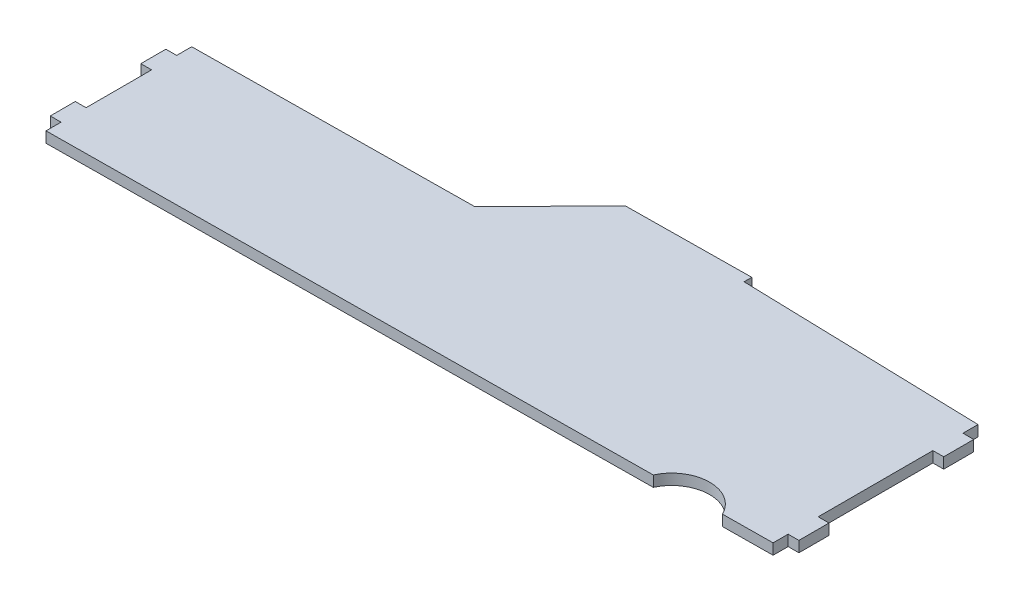
ISO-10303-21;
HEADER;
FILE_DESCRIPTION(('STEP AP214'),'2;1');
FILE_NAME('part.step','',(''),(''),'','','');
FILE_SCHEMA(('AUTOMOTIVE_DESIGN { 1 0 10303 214 1 1 1 1 }'));
ENDSEC;
DATA;
#1=APPLICATION_CONTEXT('core data for automotive mechanical design processes');
#2=APPLICATION_PROTOCOL_DEFINITION('international standard','automotive_design',2000,#1);
#3=PRODUCT_CONTEXT('',#1,'mechanical');
#4=PRODUCT('Part','Part','',(#3));
#5=PRODUCT_RELATED_PRODUCT_CATEGORY('part','',(#4));
#6=PRODUCT_DEFINITION_FORMATION('','',#4);
#7=PRODUCT_DEFINITION_CONTEXT('part definition',#1,'design');
#8=PRODUCT_DEFINITION('design','',#6,#7);
#9=PRODUCT_DEFINITION_SHAPE('','',#8);
#10=(LENGTH_UNIT() NAMED_UNIT(*) SI_UNIT(.MILLI.,.METRE.));
#11=(NAMED_UNIT(*) PLANE_ANGLE_UNIT() SI_UNIT($,.RADIAN.));
#12=(NAMED_UNIT(*) SI_UNIT($,.STERADIAN.) SOLID_ANGLE_UNIT());
#13=UNCERTAINTY_MEASURE_WITH_UNIT(LENGTH_MEASURE(1.E-05),#10,'distance_accuracy_value','');
#14=(GEOMETRIC_REPRESENTATION_CONTEXT(3) GLOBAL_UNCERTAINTY_ASSIGNED_CONTEXT((#13)) GLOBAL_UNIT_ASSIGNED_CONTEXT((#10,
#11,#12)) REPRESENTATION_CONTEXT('',''));
#15=CARTESIAN_POINT('',(0.,0.,0.));
#16=DIRECTION('',(0.,0.,1.));
#17=DIRECTION('',(1.,0.,0.));
#18=AXIS2_PLACEMENT_3D('',#15,#16,#17);
#19=CARTESIAN_POINT('',(-31.9346892249108,-4.3,41.3878146175006));
#20=DIRECTION('',(-0.714764112225223,0.,-0.699365615307822));
#21=DIRECTION('',(-0.699365615307822,0.,0.714764112225223));
#22=AXIS2_PLACEMENT_3D('',#19,#20,#21);
#23=PLANE('',#22);
#24=DIRECTION('',(-0.699365615307822,0.,0.714764112225223));
#25=VECTOR('',#24,1.);
#26=CARTESIAN_POINT('',(-31.9346892249108,0.,41.3878146175006));
#27=LINE('',#26,#25);
#28=CARTESIAN_POINT('',(-2.26311907813889,0.,11.0629415753062));
#29=VERTEX_POINT('',#28);
#30=CARTESIAN_POINT('',(-31.9346892249108,0.,41.3878146175006));
#31=VERTEX_POINT('',#30);
#32=EDGE_CURVE('E252',#29,#31,#27,.T.);
#33=ORIENTED_EDGE('',*,*,#32,.F.);
#34=DIRECTION('',(0.,1.,0.));
#35=VECTOR('',#34,1.);
#36=CARTESIAN_POINT('',(-2.26311907813889,-4.3,11.0629415753062));
#37=LINE('',#36,#35);
#38=CARTESIAN_POINT('',(-2.26311907813889,-4.3,11.0629415753062));
#39=VERTEX_POINT('',#38);
#40=EDGE_CURVE('E12',#39,#29,#37,.T.);
#41=ORIENTED_EDGE('',*,*,#40,.F.);
#42=DIRECTION('',(-0.699365615307822,0.,0.714764112225223));
#43=VECTOR('',#42,1.);
#44=CARTESIAN_POINT('',(-31.9346892249108,-4.3,41.3878146175006));
#45=LINE('',#44,#43);
#46=CARTESIAN_POINT('',(-31.9346892249108,-4.3,41.3878146175006));
#47=VERTEX_POINT('',#46);
#48=EDGE_CURVE('E326',#39,#47,#45,.T.);
#49=ORIENTED_EDGE('',*,*,#48,.T.);
#50=DIRECTION('',(0.,1.,0.));
#51=VECTOR('',#50,1.);
#52=CARTESIAN_POINT('',(-31.9346892249108,-4.3,41.3878146175006));
#53=LINE('',#52,#51);
#54=EDGE_CURVE('E50',#47,#31,#53,.T.);
#55=ORIENTED_EDGE('',*,*,#54,.T.);
#56=EDGE_LOOP('',(#33,#41,#49,#55));
#57=FACE_BOUND('',#56,.T.);
#58=ADVANCED_FACE('F47',(#57),#23,.T.);
#59=CARTESIAN_POINT('',(47.7368809218611,-4.3,10.5184902206107));
#60=DIRECTION('',(-0.01088838159038,0.,-0.999940719816101));
#61=DIRECTION('',(-0.999940719816101,0.,0.01088838159038));
#62=AXIS2_PLACEMENT_3D('',#59,#60,#61);
#63=PLANE('',#62);
#64=DIRECTION('',(-0.999940719816101,0.,0.01088838159038));
#65=VECTOR('',#64,1.);
#66=CARTESIAN_POINT('',(47.7368809218611,0.,10.5184902206107));
#67=LINE('',#66,#65);
#68=CARTESIAN_POINT('',(47.7368809218611,0.,10.5184902206107));
#69=VERTEX_POINT('',#68);
#70=EDGE_CURVE('E324',#69,#29,#67,.T.);
#71=ORIENTED_EDGE('',*,*,#70,.F.);
#72=DIRECTION('',(0.,1.,0.));
#73=VECTOR('',#72,1.);
#74=CARTESIAN_POINT('',(47.7368809218611,-4.3,10.5184902206107));
#75=LINE('',#74,#73);
#76=CARTESIAN_POINT('',(47.7368809218611,-4.3,10.5184902206107));
#77=VERTEX_POINT('',#76);
#78=EDGE_CURVE('E56',#77,#69,#75,.T.);
#79=ORIENTED_EDGE('',*,*,#78,.F.);
#80=DIRECTION('',(-0.999940719816101,0.,0.01088838159038));
#81=VECTOR('',#80,1.);
#82=CARTESIAN_POINT('',(47.7368809218611,-4.3,10.5184902206107));
#83=LINE('',#82,#81);
#84=EDGE_CURVE('E242',#77,#39,#83,.T.);
#85=ORIENTED_EDGE('',*,*,#84,.T.);
#86=ORIENTED_EDGE('',*,*,#40,.T.);
#87=EDGE_LOOP('',(#71,#79,#85,#86));
#88=FACE_BOUND('',#87,.T.);
#89=ADVANCED_FACE('F374',(#88),#63,.T.);
#90=CARTESIAN_POINT('',(47.7368809218611,-4.3,13.6103954383272));
#91=DIRECTION('',(1.,0.,0.));
#92=DIRECTION('',(0.,0.,-1.));
#93=AXIS2_PLACEMENT_3D('',#90,#91,#92);
#94=PLANE('',#93);
#95=DIRECTION('',(0.,0.,-1.));
#96=VECTOR('',#95,1.);
#97=CARTESIAN_POINT('',(47.7368809218611,0.,13.6103954383272));
#98=LINE('',#97,#96);
#99=CARTESIAN_POINT('',(47.7368809218611,0.,13.6103954383272));
#100=VERTEX_POINT('',#99);
#101=EDGE_CURVE('E229',#100,#69,#98,.T.);
#102=ORIENTED_EDGE('',*,*,#101,.F.);
#103=DIRECTION('',(0.,1.,0.));
#104=VECTOR('',#103,1.);
#105=CARTESIAN_POINT('',(47.7368809218611,-4.3,13.6103954383272));
#106=LINE('',#105,#104);
#107=CARTESIAN_POINT('',(47.7368809218611,-4.3,13.6103954383272));
#108=VERTEX_POINT('',#107);
#109=EDGE_CURVE('E224',#108,#100,#106,.T.);
#110=ORIENTED_EDGE('',*,*,#109,.F.);
#111=DIRECTION('',(0.,0.,-1.));
#112=VECTOR('',#111,1.);
#113=CARTESIAN_POINT('',(47.7368809218611,-4.3,13.6103954383272));
#114=LINE('',#113,#112);
#115=EDGE_CURVE('E227',#108,#77,#114,.T.);
#116=ORIENTED_EDGE('',*,*,#115,.T.);
#117=ORIENTED_EDGE('',*,*,#78,.T.);
#118=EDGE_LOOP('',(#102,#110,#116,#117));
#119=FACE_BOUND('',#118,.T.);
#120=ADVANCED_FACE('F226',(#119),#94,.T.);
#121=CARTESIAN_POINT('',(47.7368809218611,-4.3,13.6103954383272));
#122=DIRECTION('',(0.0276789308336633,0.,-0.999616864997737));
#123=DIRECTION('',(-0.999616864997738,0.,-0.0276789308336633));
#124=AXIS2_PLACEMENT_3D('',#121,#122,#123);
#125=PLANE('',#124);
#126=DIRECTION('',(-0.999616864997738,0.,-0.0276789308336633));
#127=VECTOR('',#126,1.);
#128=CARTESIAN_POINT('',(47.7368809218611,0.,13.6103954383272));
#129=LINE('',#128,#127);
#130=CARTESIAN_POINT('',(143.77908282957,0.,16.2697597976132));
#131=VERTEX_POINT('',#130);
#132=EDGE_CURVE('E321',#131,#100,#129,.T.);
#133=ORIENTED_EDGE('',*,*,#132,.F.);
#134=DIRECTION('',(0.,1.,0.));
#135=VECTOR('',#134,1.);
#136=CARTESIAN_POINT('',(143.77908282957,-4.3,16.2697597976132));
#137=LINE('',#136,#135);
#138=CARTESIAN_POINT('',(143.77908282957,-4.3,16.2697597976132));
#139=VERTEX_POINT('',#138);
#140=EDGE_CURVE('E234',#139,#131,#137,.T.);
#141=ORIENTED_EDGE('',*,*,#140,.F.);
#142=DIRECTION('',(-0.999616864997738,0.,-0.0276789308336633));
#143=VECTOR('',#142,1.);
#144=CARTESIAN_POINT('',(47.7368809218611,-4.3,13.6103954383272));
#145=LINE('',#144,#143);
#146=EDGE_CURVE('E240',#139,#108,#145,.T.);
#147=ORIENTED_EDGE('',*,*,#146,.T.);
#148=ORIENTED_EDGE('',*,*,#109,.T.);
#149=EDGE_LOOP('',(#133,#141,#147,#148));
#150=FACE_BOUND('',#149,.T.);
#151=ADVANCED_FACE('F244',(#150),#125,.T.);
#152=CARTESIAN_POINT('',(143.77908282957,-4.3,22.2697597976132));
#153=DIRECTION('',(1.,0.,0.));
#154=DIRECTION('',(0.,0.,-1.));
#155=AXIS2_PLACEMENT_3D('',#152,#153,#154);
#156=PLANE('',#155);
#157=DIRECTION('',(0.,0.,-1.));
#158=VECTOR('',#157,1.);
#159=CARTESIAN_POINT('',(143.77908282957,0.,22.2697597976132));
#160=LINE('',#159,#158);
#161=CARTESIAN_POINT('',(143.77908282957,0.,22.2697597976132));
#162=VERTEX_POINT('',#161);
#163=EDGE_CURVE('E318',#162,#131,#160,.T.);
#164=ORIENTED_EDGE('',*,*,#163,.F.);
#165=DIRECTION('',(0.,1.,0.));
#166=VECTOR('',#165,1.);
#167=CARTESIAN_POINT('',(143.77908282957,-4.3,22.2697597976132));
#168=LINE('',#167,#166);
#169=CARTESIAN_POINT('',(143.77908282957,-4.3,22.2697597976132));
#170=VERTEX_POINT('',#169);
#171=EDGE_CURVE('E330',#170,#162,#168,.T.);
#172=ORIENTED_EDGE('',*,*,#171,.F.);
#173=DIRECTION('',(0.,0.,-1.));
#174=VECTOR('',#173,1.);
#175=CARTESIAN_POINT('',(143.77908282957,-4.3,22.2697597976132));
#176=LINE('',#175,#174);
#177=EDGE_CURVE('E245',#170,#139,#176,.T.);
#178=ORIENTED_EDGE('',*,*,#177,.T.);
#179=ORIENTED_EDGE('',*,*,#140,.T.);
#180=EDGE_LOOP('',(#164,#172,#178,#179));
#181=FACE_BOUND('',#180,.T.);
#182=ADVANCED_FACE('F387',(#181),#156,.T.);
#183=CARTESIAN_POINT('',(143.77908282957,-4.3,22.2697597976132));
#184=DIRECTION('',(0.,0.,-1.));
#185=DIRECTION('',(-1.,0.,0.));
#186=AXIS2_PLACEMENT_3D('',#183,#184,#185);
#187=PLANE('',#186);
#188=DIRECTION('',(-1.,0.,0.));
#189=VECTOR('',#188,1.);
#190=CARTESIAN_POINT('',(143.77908282957,0.,22.2697597976132));
#191=LINE('',#190,#189);
#192=CARTESIAN_POINT('',(148.07908282957,0.,22.2697597976132));
#193=VERTEX_POINT('',#192);
#194=EDGE_CURVE('E315',#193,#162,#191,.T.);
#195=ORIENTED_EDGE('',*,*,#194,.F.);
#196=DIRECTION('',(0.,1.,0.));
#197=VECTOR('',#196,1.);
#198=CARTESIAN_POINT('',(148.07908282957,-4.3,22.2697597976132));
#199=LINE('',#198,#197);
#200=CARTESIAN_POINT('',(148.07908282957,-4.3,22.2697597976132));
#201=VERTEX_POINT('',#200);
#202=EDGE_CURVE('E332',#201,#193,#199,.T.);
#203=ORIENTED_EDGE('',*,*,#202,.F.);
#204=DIRECTION('',(-1.,0.,0.));
#205=VECTOR('',#204,1.);
#206=CARTESIAN_POINT('',(143.77908282957,-4.3,22.2697597976132));
#207=LINE('',#206,#205);
#208=EDGE_CURVE('E247',#201,#170,#207,.T.);
#209=ORIENTED_EDGE('',*,*,#208,.T.);
#210=ORIENTED_EDGE('',*,*,#171,.T.);
#211=EDGE_LOOP('',(#195,#203,#209,#210));
#212=FACE_BOUND('',#211,.T.);
#213=ADVANCED_FACE('F390',(#212),#187,.T.);
#214=CARTESIAN_POINT('',(148.07908282957,-4.3,34.2697597976132));
#215=DIRECTION('',(1.,0.,0.));
#216=DIRECTION('',(0.,0.,-1.));
#217=AXIS2_PLACEMENT_3D('',#214,#215,#216);
#218=PLANE('',#217);
#219=DIRECTION('',(0.,0.,-1.));
#220=VECTOR('',#219,1.);
#221=CARTESIAN_POINT('',(148.07908282957,0.,34.2697597976132));
#222=LINE('',#221,#220);
#223=CARTESIAN_POINT('',(148.07908282957,0.,34.2697597976132));
#224=VERTEX_POINT('',#223);
#225=EDGE_CURVE('E312',#224,#193,#222,.T.);
#226=ORIENTED_EDGE('',*,*,#225,.F.);
#227=DIRECTION('',(0.,1.,0.));
#228=VECTOR('',#227,1.);
#229=CARTESIAN_POINT('',(148.07908282957,-4.3,34.2697597976132));
#230=LINE('',#229,#228);
#231=CARTESIAN_POINT('',(148.07908282957,-4.3,34.2697597976132));
#232=VERTEX_POINT('',#231);
#233=EDGE_CURVE('E334',#232,#224,#230,.T.);
#234=ORIENTED_EDGE('',*,*,#233,.F.);
#235=DIRECTION('',(0.,0.,-1.));
#236=VECTOR('',#235,1.);
#237=CARTESIAN_POINT('',(148.07908282957,-4.3,34.2697597976132));
#238=LINE('',#237,#236);
#239=EDGE_CURVE('E711',#232,#201,#238,.T.);
#240=ORIENTED_EDGE('',*,*,#239,.T.);
#241=ORIENTED_EDGE('',*,*,#202,.T.);
#242=EDGE_LOOP('',(#226,#234,#240,#241));
#243=FACE_BOUND('',#242,.T.);
#244=ADVANCED_FACE('F394',(#243),#218,.T.);
#245=CARTESIAN_POINT('',(143.77908282957,-4.3,34.2697597976132));
#246=DIRECTION('',(0.,0.,1.));
#247=DIRECTION('',(1.,0.,0.));
#248=AXIS2_PLACEMENT_3D('',#245,#246,#247);
#249=PLANE('',#248);
#250=DIRECTION('',(1.,0.,0.));
#251=VECTOR('',#250,1.);
#252=CARTESIAN_POINT('',(143.77908282957,0.,34.2697597976132));
#253=LINE('',#252,#251);
#254=CARTESIAN_POINT('',(143.77908282957,0.,34.2697597976132));
#255=VERTEX_POINT('',#254);
#256=EDGE_CURVE('E309',#255,#224,#253,.T.);
#257=ORIENTED_EDGE('',*,*,#256,.F.);
#258=DIRECTION('',(0.,1.,0.));
#259=VECTOR('',#258,1.);
#260=CARTESIAN_POINT('',(143.77908282957,-4.3,34.2697597976132));
#261=LINE('',#260,#259);
#262=CARTESIAN_POINT('',(143.77908282957,-4.3,34.2697597976132));
#263=VERTEX_POINT('',#262);
#264=EDGE_CURVE('E336',#263,#255,#261,.T.);
#265=ORIENTED_EDGE('',*,*,#264,.F.);
#266=DIRECTION('',(1.,0.,0.));
#267=VECTOR('',#266,1.);
#268=CARTESIAN_POINT('',(143.77908282957,-4.3,34.2697597976132));
#269=LINE('',#268,#267);
#270=EDGE_CURVE('E704',#263,#232,#269,.T.);
#271=ORIENTED_EDGE('',*,*,#270,.T.);
#272=ORIENTED_EDGE('',*,*,#233,.T.);
#273=EDGE_LOOP('',(#257,#265,#271,#272));
#274=FACE_BOUND('',#273,.T.);
#275=ADVANCED_FACE('F398',(#274),#249,.T.);
#276=CARTESIAN_POINT('',(143.77908282957,-4.3,80.0683917908743));
#277=DIRECTION('',(1.,0.,0.));
#278=DIRECTION('',(0.,0.,-1.));
#279=AXIS2_PLACEMENT_3D('',#276,#277,#278);
#280=PLANE('',#279);
#281=DIRECTION('',(0.,0.,-1.));
#282=VECTOR('',#281,1.);
#283=CARTESIAN_POINT('',(143.77908282957,0.,80.0683917908743));
#284=LINE('',#283,#282);
#285=CARTESIAN_POINT('',(143.77908282957,0.,80.0683917908743));
#286=VERTEX_POINT('',#285);
#287=EDGE_CURVE('E306',#286,#255,#284,.T.);
#288=ORIENTED_EDGE('',*,*,#287,.F.);
#289=DIRECTION('',(0.,1.,0.));
#290=VECTOR('',#289,1.);
#291=CARTESIAN_POINT('',(143.77908282957,-4.3,80.0683917908743));
#292=LINE('',#291,#290);
#293=CARTESIAN_POINT('',(143.77908282957,-4.3,80.0683917908743));
#294=VERTEX_POINT('',#293);
#295=EDGE_CURVE('E338',#294,#286,#292,.T.);
#296=ORIENTED_EDGE('',*,*,#295,.F.);
#297=DIRECTION('',(0.,0.,-1.));
#298=VECTOR('',#297,1.);
#299=CARTESIAN_POINT('',(143.77908282957,-4.3,80.0683917908743));
#300=LINE('',#299,#298);
#301=EDGE_CURVE('E700',#294,#263,#300,.T.);
#302=ORIENTED_EDGE('',*,*,#301,.T.);
#303=ORIENTED_EDGE('',*,*,#264,.T.);
#304=EDGE_LOOP('',(#288,#296,#302,#303));
#305=FACE_BOUND('',#304,.T.);
#306=ADVANCED_FACE('F402',(#305),#280,.T.);
#307=CARTESIAN_POINT('',(143.77908282957,-4.3,80.0683917908743));
#308=DIRECTION('',(0.,0.,-1.));
#309=DIRECTION('',(-1.,0.,0.));
#310=AXIS2_PLACEMENT_3D('',#307,#308,#309);
#311=PLANE('',#310);
#312=DIRECTION('',(-1.,0.,0.));
#313=VECTOR('',#312,1.);
#314=CARTESIAN_POINT('',(143.77908282957,0.,80.0683917908743));
#315=LINE('',#314,#313);
#316=CARTESIAN_POINT('',(148.07908282957,0.,80.0683917908743));
#317=VERTEX_POINT('',#316);
#318=EDGE_CURVE('E303',#317,#286,#315,.T.);
#319=ORIENTED_EDGE('',*,*,#318,.F.);
#320=DIRECTION('',(0.,1.,0.));
#321=VECTOR('',#320,1.);
#322=CARTESIAN_POINT('',(148.07908282957,-4.3,80.0683917908743));
#323=LINE('',#322,#321);
#324=CARTESIAN_POINT('',(148.07908282957,-4.3,80.0683917908743));
#325=VERTEX_POINT('',#324);
#326=EDGE_CURVE('E340',#325,#317,#323,.T.);
#327=ORIENTED_EDGE('',*,*,#326,.F.);
#328=DIRECTION('',(-1.,0.,0.));
#329=VECTOR('',#328,1.);
#330=CARTESIAN_POINT('',(143.77908282957,-4.3,80.0683917908743));
#331=LINE('',#330,#329);
#332=EDGE_CURVE('E716',#325,#294,#331,.T.);
#333=ORIENTED_EDGE('',*,*,#332,.T.);
#334=ORIENTED_EDGE('',*,*,#295,.T.);
#335=EDGE_LOOP('',(#319,#327,#333,#334));
#336=FACE_BOUND('',#335,.T.);
#337=ADVANCED_FACE('F406',(#336),#311,.T.);
#338=CARTESIAN_POINT('',(148.07908282957,-4.3,92.0683917908743));
#339=DIRECTION('',(1.,0.,0.));
#340=DIRECTION('',(0.,0.,-1.));
#341=AXIS2_PLACEMENT_3D('',#338,#339,#340);
#342=PLANE('',#341);
#343=DIRECTION('',(0.,0.,-1.));
#344=VECTOR('',#343,1.);
#345=CARTESIAN_POINT('',(148.07908282957,0.,92.0683917908743));
#346=LINE('',#345,#344);
#347=CARTESIAN_POINT('',(148.07908282957,0.,92.0683917908743));
#348=VERTEX_POINT('',#347);
#349=EDGE_CURVE('E300',#348,#317,#346,.T.);
#350=ORIENTED_EDGE('',*,*,#349,.F.);
#351=DIRECTION('',(0.,1.,0.));
#352=VECTOR('',#351,1.);
#353=CARTESIAN_POINT('',(148.07908282957,-4.3,92.0683917908743));
#354=LINE('',#353,#352);
#355=CARTESIAN_POINT('',(148.07908282957,-4.3,92.0683917908743));
#356=VERTEX_POINT('',#355);
#357=EDGE_CURVE('E342',#356,#348,#354,.T.);
#358=ORIENTED_EDGE('',*,*,#357,.F.);
#359=DIRECTION('',(0.,0.,-1.));
#360=VECTOR('',#359,1.);
#361=CARTESIAN_POINT('',(148.07908282957,-4.3,92.0683917908743));
#362=LINE('',#361,#360);
#363=EDGE_CURVE('E693',#356,#325,#362,.T.);
#364=ORIENTED_EDGE('',*,*,#363,.T.);
#365=ORIENTED_EDGE('',*,*,#326,.T.);
#366=EDGE_LOOP('',(#350,#358,#364,#365));
#367=FACE_BOUND('',#366,.T.);
#368=ADVANCED_FACE('F410',(#367),#342,.T.);
#369=CARTESIAN_POINT('',(143.77908282957,-4.3,92.0683917908743));
#370=DIRECTION('',(0.,0.,1.));
#371=DIRECTION('',(1.,0.,0.));
#372=AXIS2_PLACEMENT_3D('',#369,#370,#371);
#373=PLANE('',#372);
#374=DIRECTION('',(1.,0.,0.));
#375=VECTOR('',#374,1.);
#376=CARTESIAN_POINT('',(143.77908282957,0.,92.0683917908743));
#377=LINE('',#376,#375);
#378=CARTESIAN_POINT('',(143.77908282957,0.,92.0683917908743));
#379=VERTEX_POINT('',#378);
#380=EDGE_CURVE('E297',#379,#348,#377,.T.);
#381=ORIENTED_EDGE('',*,*,#380,.F.);
#382=DIRECTION('',(0.,1.,0.));
#383=VECTOR('',#382,1.);
#384=CARTESIAN_POINT('',(143.77908282957,-4.3,92.0683917908743));
#385=LINE('',#384,#383);
#386=CARTESIAN_POINT('',(143.77908282957,-4.3,92.0683917908743));
#387=VERTEX_POINT('',#386);
#388=EDGE_CURVE('E344',#387,#379,#385,.T.);
#389=ORIENTED_EDGE('',*,*,#388,.F.);
#390=DIRECTION('',(1.,0.,0.));
#391=VECTOR('',#390,1.);
#392=CARTESIAN_POINT('',(143.77908282957,-4.3,92.0683917908743));
#393=LINE('',#392,#391);
#394=EDGE_CURVE('E689',#387,#356,#393,.T.);
#395=ORIENTED_EDGE('',*,*,#394,.T.);
#396=ORIENTED_EDGE('',*,*,#357,.T.);
#397=EDGE_LOOP('',(#381,#389,#395,#396));
#398=FACE_BOUND('',#397,.T.);
#399=ADVANCED_FACE('F414',(#398),#373,.T.);
#400=CARTESIAN_POINT('',(143.77908282957,-4.3,98.0683917908743));
#401=DIRECTION('',(1.,0.,0.));
#402=DIRECTION('',(0.,0.,-1.));
#403=AXIS2_PLACEMENT_3D('',#400,#401,#402);
#404=PLANE('',#403);
#405=DIRECTION('',(0.,0.,-1.));
#406=VECTOR('',#405,1.);
#407=CARTESIAN_POINT('',(143.77908282957,0.,98.0683917908743));
#408=LINE('',#407,#406);
#409=CARTESIAN_POINT('',(143.77908282957,0.,98.0683917908743));
#410=VERTEX_POINT('',#409);
#411=EDGE_CURVE('E294',#410,#379,#408,.T.);
#412=ORIENTED_EDGE('',*,*,#411,.F.);
#413=DIRECTION('',(0.,1.,0.));
#414=VECTOR('',#413,1.);
#415=CARTESIAN_POINT('',(143.77908282957,-4.3,98.0683917908743));
#416=LINE('',#415,#414);
#417=CARTESIAN_POINT('',(143.77908282957,-4.3,98.0683917908743));
#418=VERTEX_POINT('',#417);
#419=EDGE_CURVE('E346',#418,#410,#416,.T.);
#420=ORIENTED_EDGE('',*,*,#419,.F.);
#421=DIRECTION('',(0.,0.,-1.));
#422=VECTOR('',#421,1.);
#423=CARTESIAN_POINT('',(143.77908282957,-4.3,98.0683917908743));
#424=LINE('',#423,#422);
#425=EDGE_CURVE('E720',#418,#387,#424,.T.);
#426=ORIENTED_EDGE('',*,*,#425,.T.);
#427=ORIENTED_EDGE('',*,*,#388,.T.);
#428=EDGE_LOOP('',(#412,#420,#426,#427));
#429=FACE_BOUND('',#428,.T.);
#430=ADVANCED_FACE('F418',(#429),#404,.T.);
#431=CARTESIAN_POINT('',(143.77908282957,-4.3,98.0683917908743));
#432=DIRECTION('',(0.00936633570846425,0.,0.999956134915625));
#433=DIRECTION('',(0.999956134915626,0.,-0.00936633570846425));
#434=AXIS2_PLACEMENT_3D('',#431,#432,#433);
#435=PLANE('',#434);
#436=DIRECTION('',(0.999956134915625,0.,-0.00936633570846425));
#437=VECTOR('',#436,1.);
#438=CARTESIAN_POINT('',(143.77908282957,0.,98.0683917908743));
#439=LINE('',#438,#437);
#440=CARTESIAN_POINT('',(123.769012786662,0.,98.2558210460462));
#441=VERTEX_POINT('',#440);
#442=EDGE_CURVE('E291',#441,#410,#439,.T.);
#443=ORIENTED_EDGE('',*,*,#442,.F.);
#444=DIRECTION('',(0.,1.,0.));
#445=VECTOR('',#444,1.);
#446=CARTESIAN_POINT('',(123.769012786662,-4.3,98.2558210460462));
#447=LINE('',#446,#445);
#448=CARTESIAN_POINT('',(123.769012786662,-4.3,98.2558210460462));
#449=VERTEX_POINT('',#448);
#450=EDGE_CURVE('E348',#449,#441,#447,.T.);
#451=ORIENTED_EDGE('',*,*,#450,.F.);
#452=DIRECTION('',(0.999956134915625,0.,-0.00936633570846425));
#453=VECTOR('',#452,1.);
#454=CARTESIAN_POINT('',(143.77908282957,-4.3,98.0683917908743));
#455=LINE('',#454,#453);
#456=EDGE_CURVE('E682',#449,#418,#455,.T.);
#457=ORIENTED_EDGE('',*,*,#456,.T.);
#458=ORIENTED_EDGE('',*,*,#419,.T.);
#459=EDGE_LOOP('',(#443,#451,#457,#458));
#460=FACE_BOUND('',#459,.T.);
#461=ADVANCED_FACE('F422',(#460),#435,.T.);
#462=CARTESIAN_POINT('',(110.140489553155,-4.3,104.915689165582));
#463=DIRECTION('',(0.,1.,0.));
#464=DIRECTION('',(0.,0.,1.));
#465=AXIS2_PLACEMENT_3D('',#462,#463,#464);
#466=CYLINDRICAL_SURFACE('',#465,15.1687339252769);
#467=CARTESIAN_POINT('',(110.140489553155,0.,104.915689165582));
#468=DIRECTION('',(0.,-1.,0.));
#469=DIRECTION('',(0.,0.,-1.));
#470=AXIS2_PLACEMENT_3D('',#467,#468,#469);
#471=CIRCLE('',#470,15.1687339252769);
#472=CARTESIAN_POINT('',(96.3896058838056,0.,98.5122770120596));
#473=VERTEX_POINT('',#472);
#474=EDGE_CURVE('E288',#473,#441,#471,.T.);
#475=ORIENTED_EDGE('',*,*,#474,.F.);
#476=DIRECTION('',(0.,1.,0.));
#477=VECTOR('',#476,1.);
#478=CARTESIAN_POINT('',(96.3896058838056,-4.3,98.5122770120596));
#479=LINE('',#478,#477);
#480=CARTESIAN_POINT('',(96.3896058838056,-4.3,98.5122770120596));
#481=VERTEX_POINT('',#480);
#482=EDGE_CURVE('E350',#481,#473,#479,.T.);
#483=ORIENTED_EDGE('',*,*,#482,.F.);
#484=CARTESIAN_POINT('',(110.140489553155,-4.3,104.915689165582));
#485=DIRECTION('',(0.,-1.,0.));
#486=DIRECTION('',(0.,0.,-1.));
#487=AXIS2_PLACEMENT_3D('',#484,#485,#486);
#488=CIRCLE('',#487,15.1687339252769);
#489=EDGE_CURVE('E678',#481,#449,#488,.T.);
#490=ORIENTED_EDGE('',*,*,#489,.T.);
#491=ORIENTED_EDGE('',*,*,#450,.T.);
#492=EDGE_LOOP('',(#475,#483,#490,#491));
#493=FACE_BOUND('',#492,.T.);
#494=ADVANCED_FACE('F426',(#493),#466,.F.);
#495=CARTESIAN_POINT('',(96.3896058838056,-4.3,98.5122770120596));
#496=DIRECTION('',(0.00936633570846373,0.,0.999956134915625));
#497=DIRECTION('',(0.999956134915626,0.,-0.00936633570846373));
#498=AXIS2_PLACEMENT_3D('',#495,#496,#497);
#499=PLANE('',#498);
#500=DIRECTION('',(0.999956134915625,0.,-0.00936633570846373));
#501=VECTOR('',#500,1.);
#502=CARTESIAN_POINT('',(96.3896058838056,0.,98.5122770120596));
#503=LINE('',#502,#501);
#504=CARTESIAN_POINT('',(-143.77908282957,0.,100.761876256071));
#505=VERTEX_POINT('',#504);
#506=EDGE_CURVE('E285',#505,#473,#503,.T.);
#507=ORIENTED_EDGE('',*,*,#506,.F.);
#508=DIRECTION('',(0.,1.,0.));
#509=VECTOR('',#508,1.);
#510=CARTESIAN_POINT('',(-143.77908282957,-4.3,100.761876256071));
#511=LINE('',#510,#509);
#512=CARTESIAN_POINT('',(-143.77908282957,-4.3,100.761876256071));
#513=VERTEX_POINT('',#512);
#514=EDGE_CURVE('E352',#513,#505,#511,.T.);
#515=ORIENTED_EDGE('',*,*,#514,.F.);
#516=DIRECTION('',(0.999956134915625,0.,-0.00936633570846373));
#517=VECTOR('',#516,1.);
#518=CARTESIAN_POINT('',(96.3896058838056,-4.3,98.5122770120596));
#519=LINE('',#518,#517);
#520=EDGE_CURVE('E724',#513,#481,#519,.T.);
#521=ORIENTED_EDGE('',*,*,#520,.T.);
#522=ORIENTED_EDGE('',*,*,#482,.T.);
#523=EDGE_LOOP('',(#507,#515,#521,#522));
#524=FACE_BOUND('',#523,.T.);
#525=ADVANCED_FACE('F430',(#524),#499,.T.);
#526=CARTESIAN_POINT('',(-143.77908282957,-4.3,100.761876256071));
#527=DIRECTION('',(-1.,0.,0.));
#528=DIRECTION('',(0.,0.,1.));
#529=AXIS2_PLACEMENT_3D('',#526,#527,#528);
#530=PLANE('',#529);
#531=DIRECTION('',(0.,0.,1.));
#532=VECTOR('',#531,1.);
#533=CARTESIAN_POINT('',(-143.77908282957,0.,100.761876256071));
#534=LINE('',#533,#532);
#535=CARTESIAN_POINT('',(-143.77908282957,0.,94.7618762560712));
#536=VERTEX_POINT('',#535);
#537=EDGE_CURVE('E282',#536,#505,#534,.T.);
#538=ORIENTED_EDGE('',*,*,#537,.F.);
#539=DIRECTION('',(0.,1.,0.));
#540=VECTOR('',#539,1.);
#541=CARTESIAN_POINT('',(-143.77908282957,-4.3,94.7618762560712));
#542=LINE('',#541,#540);
#543=CARTESIAN_POINT('',(-143.77908282957,-4.3,94.7618762560712));
#544=VERTEX_POINT('',#543);
#545=EDGE_CURVE('E354',#544,#536,#542,.T.);
#546=ORIENTED_EDGE('',*,*,#545,.F.);
#547=DIRECTION('',(0.,0.,1.));
#548=VECTOR('',#547,1.);
#549=CARTESIAN_POINT('',(-143.77908282957,-4.3,100.761876256071));
#550=LINE('',#549,#548);
#551=EDGE_CURVE('E671',#544,#513,#550,.T.);
#552=ORIENTED_EDGE('',*,*,#551,.T.);
#553=ORIENTED_EDGE('',*,*,#514,.T.);
#554=EDGE_LOOP('',(#538,#546,#552,#553));
#555=FACE_BOUND('',#554,.T.);
#556=ADVANCED_FACE('F434',(#555),#530,.T.);
#557=CARTESIAN_POINT('',(-143.77908282957,-4.3,94.7618762560712));
#558=DIRECTION('',(0.,0.,1.));
#559=DIRECTION('',(1.,0.,0.));
#560=AXIS2_PLACEMENT_3D('',#557,#558,#559);
#561=PLANE('',#560);
#562=DIRECTION('',(1.,0.,0.));
#563=VECTOR('',#562,1.);
#564=CARTESIAN_POINT('',(-143.77908282957,0.,94.7618762560712));
#565=LINE('',#564,#563);
#566=CARTESIAN_POINT('',(-148.07908282957,0.,94.7618762560712));
#567=VERTEX_POINT('',#566);
#568=EDGE_CURVE('E279',#567,#536,#565,.T.);
#569=ORIENTED_EDGE('',*,*,#568,.F.);
#570=DIRECTION('',(0.,1.,0.));
#571=VECTOR('',#570,1.);
#572=CARTESIAN_POINT('',(-148.07908282957,-4.3,94.7618762560712));
#573=LINE('',#572,#571);
#574=CARTESIAN_POINT('',(-148.07908282957,-4.3,94.7618762560712));
#575=VERTEX_POINT('',#574);
#576=EDGE_CURVE('E356',#575,#567,#573,.T.);
#577=ORIENTED_EDGE('',*,*,#576,.F.);
#578=DIRECTION('',(1.,0.,0.));
#579=VECTOR('',#578,1.);
#580=CARTESIAN_POINT('',(-143.77908282957,-4.3,94.7618762560712));
#581=LINE('',#580,#579);
#582=EDGE_CURVE('E667',#575,#544,#581,.T.);
#583=ORIENTED_EDGE('',*,*,#582,.T.);
#584=ORIENTED_EDGE('',*,*,#545,.T.);
#585=EDGE_LOOP('',(#569,#577,#583,#584));
#586=FACE_BOUND('',#585,.T.);
#587=ADVANCED_FACE('F438',(#586),#561,.T.);
#588=CARTESIAN_POINT('',(-148.07908282957,-4.3,94.7618762560712));
#589=DIRECTION('',(-1.,0.,0.));
#590=DIRECTION('',(0.,0.,1.));
#591=AXIS2_PLACEMENT_3D('',#588,#589,#590);
#592=PLANE('',#591);
#593=DIRECTION('',(0.,0.,1.));
#594=VECTOR('',#593,1.);
#595=CARTESIAN_POINT('',(-148.07908282957,0.,94.7618762560712));
#596=LINE('',#595,#594);
#597=CARTESIAN_POINT('',(-148.07908282957,0.,84.7618762560712));
#598=VERTEX_POINT('',#597);
#599=EDGE_CURVE('E276',#598,#567,#596,.T.);
#600=ORIENTED_EDGE('',*,*,#599,.F.);
#601=DIRECTION('',(0.,1.,0.));
#602=VECTOR('',#601,1.);
#603=CARTESIAN_POINT('',(-148.07908282957,-4.3,84.7618762560712));
#604=LINE('',#603,#602);
#605=CARTESIAN_POINT('',(-148.07908282957,-4.3,84.7618762560712));
#606=VERTEX_POINT('',#605);
#607=EDGE_CURVE('E358',#606,#598,#604,.T.);
#608=ORIENTED_EDGE('',*,*,#607,.F.);
#609=DIRECTION('',(0.,0.,1.));
#610=VECTOR('',#609,1.);
#611=CARTESIAN_POINT('',(-148.07908282957,-4.3,94.7618762560712));
#612=LINE('',#611,#610);
#613=EDGE_CURVE('E728',#606,#575,#612,.T.);
#614=ORIENTED_EDGE('',*,*,#613,.T.);
#615=ORIENTED_EDGE('',*,*,#576,.T.);
#616=EDGE_LOOP('',(#600,#608,#614,#615));
#617=FACE_BOUND('',#616,.T.);
#618=ADVANCED_FACE('F442',(#617),#592,.T.);
#619=CARTESIAN_POINT('',(-143.77908282957,-4.3,84.7618762560712));
#620=DIRECTION('',(0.,0.,-1.));
#621=DIRECTION('',(-1.,0.,0.));
#622=AXIS2_PLACEMENT_3D('',#619,#620,#621);
#623=PLANE('',#622);
#624=DIRECTION('',(-1.,0.,0.));
#625=VECTOR('',#624,1.);
#626=CARTESIAN_POINT('',(-143.77908282957,0.,84.7618762560712));
#627=LINE('',#626,#625);
#628=CARTESIAN_POINT('',(-143.77908282957,0.,84.7618762560712));
#629=VERTEX_POINT('',#628);
#630=EDGE_CURVE('E273',#629,#598,#627,.T.);
#631=ORIENTED_EDGE('',*,*,#630,.F.);
#632=DIRECTION('',(0.,1.,0.));
#633=VECTOR('',#632,1.);
#634=CARTESIAN_POINT('',(-143.77908282957,-4.3,84.7618762560712));
#635=LINE('',#634,#633);
#636=CARTESIAN_POINT('',(-143.77908282957,-4.3,84.7618762560712));
#637=VERTEX_POINT('',#636);
#638=EDGE_CURVE('E360',#637,#629,#635,.T.);
#639=ORIENTED_EDGE('',*,*,#638,.F.);
#640=DIRECTION('',(-1.,0.,0.));
#641=VECTOR('',#640,1.);
#642=CARTESIAN_POINT('',(-143.77908282957,-4.3,84.7618762560712));
#643=LINE('',#642,#641);
#644=EDGE_CURVE('E660',#637,#606,#643,.T.);
#645=ORIENTED_EDGE('',*,*,#644,.T.);
#646=ORIENTED_EDGE('',*,*,#607,.T.);
#647=EDGE_LOOP('',(#631,#639,#645,#646));
#648=FACE_BOUND('',#647,.T.);
#649=ADVANCED_FACE('F446',(#648),#623,.T.);
#650=CARTESIAN_POINT('',(-143.77908282957,-4.3,84.7618762560712));
#651=DIRECTION('',(-1.,0.,0.));
#652=DIRECTION('',(0.,0.,1.));
#653=AXIS2_PLACEMENT_3D('',#650,#651,#652);
#654=PLANE('',#653);
#655=DIRECTION('',(0.,0.,1.));
#656=VECTOR('',#655,1.);
#657=CARTESIAN_POINT('',(-143.77908282957,0.,84.7618762560712));
#658=LINE('',#657,#656);
#659=CARTESIAN_POINT('',(-143.77908282957,0.,58.6056912497635));
#660=VERTEX_POINT('',#659);
#661=EDGE_CURVE('E270',#660,#629,#658,.T.);
#662=ORIENTED_EDGE('',*,*,#661,.F.);
#663=DIRECTION('',(0.,1.,0.));
#664=VECTOR('',#663,1.);
#665=CARTESIAN_POINT('',(-143.77908282957,-4.3,58.6056912497635));
#666=LINE('',#665,#664);
#667=CARTESIAN_POINT('',(-143.77908282957,-4.3,58.6056912497635));
#668=VERTEX_POINT('',#667);
#669=EDGE_CURVE('E362',#668,#660,#666,.T.);
#670=ORIENTED_EDGE('',*,*,#669,.F.);
#671=DIRECTION('',(0.,0.,1.));
#672=VECTOR('',#671,1.);
#673=CARTESIAN_POINT('',(-143.77908282957,-4.3,84.7618762560712));
#674=LINE('',#673,#672);
#675=EDGE_CURVE('E656',#668,#637,#674,.T.);
#676=ORIENTED_EDGE('',*,*,#675,.T.);
#677=ORIENTED_EDGE('',*,*,#638,.T.);
#678=EDGE_LOOP('',(#662,#670,#676,#677));
#679=FACE_BOUND('',#678,.T.);
#680=ADVANCED_FACE('F450',(#679),#654,.T.);
#681=CARTESIAN_POINT('',(-143.77908282957,-4.3,58.6056912497635));
#682=DIRECTION('',(0.,0.,1.));
#683=DIRECTION('',(1.,0.,0.));
#684=AXIS2_PLACEMENT_3D('',#681,#682,#683);
#685=PLANE('',#684);
#686=DIRECTION('',(1.,0.,0.));
#687=VECTOR('',#686,1.);
#688=CARTESIAN_POINT('',(-143.77908282957,0.,58.6056912497635));
#689=LINE('',#688,#687);
#690=CARTESIAN_POINT('',(-148.07908282957,0.,58.6056912497635));
#691=VERTEX_POINT('',#690);
#692=EDGE_CURVE('E267',#691,#660,#689,.T.);
#693=ORIENTED_EDGE('',*,*,#692,.F.);
#694=DIRECTION('',(0.,1.,0.));
#695=VECTOR('',#694,1.);
#696=CARTESIAN_POINT('',(-148.07908282957,-4.3,58.6056912497635));
#697=LINE('',#696,#695);
#698=CARTESIAN_POINT('',(-148.07908282957,-4.3,58.6056912497635));
#699=VERTEX_POINT('',#698);
#700=EDGE_CURVE('E364',#699,#691,#697,.T.);
#701=ORIENTED_EDGE('',*,*,#700,.F.);
#702=DIRECTION('',(1.,0.,0.));
#703=VECTOR('',#702,1.);
#704=CARTESIAN_POINT('',(-143.77908282957,-4.3,58.6056912497635));
#705=LINE('',#704,#703);
#706=EDGE_CURVE('E732',#699,#668,#705,.T.);
#707=ORIENTED_EDGE('',*,*,#706,.T.);
#708=ORIENTED_EDGE('',*,*,#669,.T.);
#709=EDGE_LOOP('',(#693,#701,#707,#708));
#710=FACE_BOUND('',#709,.T.);
#711=ADVANCED_FACE('F454',(#710),#685,.T.);
#712=CARTESIAN_POINT('',(-148.07908282957,-4.3,58.6056912497635));
#713=DIRECTION('',(-1.,0.,0.));
#714=DIRECTION('',(0.,0.,1.));
#715=AXIS2_PLACEMENT_3D('',#712,#713,#714);
#716=PLANE('',#715);
#717=DIRECTION('',(0.,0.,1.));
#718=VECTOR('',#717,1.);
#719=CARTESIAN_POINT('',(-148.07908282957,0.,58.6056912497635));
#720=LINE('',#719,#718);
#721=CARTESIAN_POINT('',(-148.07908282957,0.,48.6056912497635));
#722=VERTEX_POINT('',#721);
#723=EDGE_CURVE('E264',#722,#691,#720,.T.);
#724=ORIENTED_EDGE('',*,*,#723,.F.);
#725=DIRECTION('',(0.,1.,0.));
#726=VECTOR('',#725,1.);
#727=CARTESIAN_POINT('',(-148.07908282957,-4.3,48.6056912497635));
#728=LINE('',#727,#726);
#729=CARTESIAN_POINT('',(-148.07908282957,-4.3,48.6056912497635));
#730=VERTEX_POINT('',#729);
#731=EDGE_CURVE('E366',#730,#722,#728,.T.);
#732=ORIENTED_EDGE('',*,*,#731,.F.);
#733=DIRECTION('',(0.,0.,1.));
#734=VECTOR('',#733,1.);
#735=CARTESIAN_POINT('',(-148.07908282957,-4.3,58.6056912497635));
#736=LINE('',#735,#734);
#737=EDGE_CURVE('E649',#730,#699,#736,.T.);
#738=ORIENTED_EDGE('',*,*,#737,.T.);
#739=ORIENTED_EDGE('',*,*,#700,.T.);
#740=EDGE_LOOP('',(#724,#732,#738,#739));
#741=FACE_BOUND('',#740,.T.);
#742=ADVANCED_FACE('F458',(#741),#716,.T.);
#743=CARTESIAN_POINT('',(-143.77908282957,-4.3,48.6056912497635));
#744=DIRECTION('',(0.,0.,-1.));
#745=DIRECTION('',(-1.,0.,0.));
#746=AXIS2_PLACEMENT_3D('',#743,#744,#745);
#747=PLANE('',#746);
#748=DIRECTION('',(-1.,0.,0.));
#749=VECTOR('',#748,1.);
#750=CARTESIAN_POINT('',(-143.77908282957,0.,48.6056912497635));
#751=LINE('',#750,#749);
#752=CARTESIAN_POINT('',(-143.77908282957,0.,48.6056912497635));
#753=VERTEX_POINT('',#752);
#754=EDGE_CURVE('E261',#753,#722,#751,.T.);
#755=ORIENTED_EDGE('',*,*,#754,.F.);
#756=DIRECTION('',(0.,1.,0.));
#757=VECTOR('',#756,1.);
#758=CARTESIAN_POINT('',(-143.77908282957,-4.3,48.6056912497635));
#759=LINE('',#758,#757);
#760=CARTESIAN_POINT('',(-143.77908282957,-4.3,48.6056912497635));
#761=VERTEX_POINT('',#760);
#762=EDGE_CURVE('E368',#761,#753,#759,.T.);
#763=ORIENTED_EDGE('',*,*,#762,.F.);
#764=DIRECTION('',(-1.,0.,0.));
#765=VECTOR('',#764,1.);
#766=CARTESIAN_POINT('',(-143.77908282957,-4.3,48.6056912497635));
#767=LINE('',#766,#765);
#768=EDGE_CURVE('E645',#761,#730,#767,.T.);
#769=ORIENTED_EDGE('',*,*,#768,.T.);
#770=ORIENTED_EDGE('',*,*,#731,.T.);
#771=EDGE_LOOP('',(#755,#763,#769,#770));
#772=FACE_BOUND('',#771,.T.);
#773=ADVANCED_FACE('F462',(#772),#747,.T.);
#774=CARTESIAN_POINT('',(-143.77908282957,-4.3,48.6056912497635));
#775=DIRECTION('',(-1.,0.,0.));
#776=DIRECTION('',(0.,0.,1.));
#777=AXIS2_PLACEMENT_3D('',#774,#775,#776);
#778=PLANE('',#777);
#779=DIRECTION('',(0.,0.,1.));
#780=VECTOR('',#779,1.);
#781=CARTESIAN_POINT('',(-143.77908282957,0.,48.6056912497635));
#782=LINE('',#781,#780);
#783=CARTESIAN_POINT('',(-143.77908282957,0.,42.6056912497635));
#784=VERTEX_POINT('',#783);
#785=EDGE_CURVE('E258',#784,#753,#782,.T.);
#786=ORIENTED_EDGE('',*,*,#785,.F.);
#787=DIRECTION('',(0.,1.,0.));
#788=VECTOR('',#787,1.);
#789=CARTESIAN_POINT('',(-143.77908282957,-4.3,42.6056912497635));
#790=LINE('',#789,#788);
#791=CARTESIAN_POINT('',(-143.77908282957,-4.3,42.6056912497635));
#792=VERTEX_POINT('',#791);
#793=EDGE_CURVE('E369',#792,#784,#790,.T.);
#794=ORIENTED_EDGE('',*,*,#793,.F.);
#795=DIRECTION('',(0.,0.,1.));
#796=VECTOR('',#795,1.);
#797=CARTESIAN_POINT('',(-143.77908282957,-4.3,48.6056912497635));
#798=LINE('',#797,#796);
#799=EDGE_CURVE('E736',#792,#761,#798,.T.);
#800=ORIENTED_EDGE('',*,*,#799,.T.);
#801=ORIENTED_EDGE('',*,*,#762,.T.);
#802=EDGE_LOOP('',(#786,#794,#800,#801));
#803=FACE_BOUND('',#802,.T.);
#804=ADVANCED_FACE('F466',(#803),#778,.T.);
#805=CARTESIAN_POINT('',(-143.77908282957,-4.3,42.6056912497635));
#806=DIRECTION('',(-0.0108883815903801,0.,-0.999940719816101));
#807=DIRECTION('',(-0.999940719816101,0.,0.0108883815903801));
#808=AXIS2_PLACEMENT_3D('',#805,#806,#807);
#809=PLANE('',#808);
#810=DIRECTION('',(-0.999940719816101,0.,0.0108883815903801));
#811=VECTOR('',#810,1.);
#812=CARTESIAN_POINT('',(-143.77908282957,0.,42.6056912497635));
#813=LINE('',#812,#811);
#814=EDGE_CURVE('E255',#31,#784,#813,.T.);
#815=ORIENTED_EDGE('',*,*,#814,.F.);
#816=ORIENTED_EDGE('',*,*,#54,.F.);
#817=DIRECTION('',(-0.999940719816101,0.,0.0108883815903801));
#818=VECTOR('',#817,1.);
#819=CARTESIAN_POINT('',(-143.77908282957,-4.3,42.6056912497635));
#820=LINE('',#819,#818);
#821=EDGE_CURVE('E738',#47,#792,#820,.T.);
#822=ORIENTED_EDGE('',*,*,#821,.T.);
#823=ORIENTED_EDGE('',*,*,#793,.T.);
#824=EDGE_LOOP('',(#815,#816,#822,#823));
#825=FACE_BOUND('',#824,.T.);
#826=ADVANCED_FACE('F371',(#825),#809,.T.);
#827=CARTESIAN_POINT('',(110.140489553155,-4.3,104.915689165582));
#828=DIRECTION('',(0.,-1.,0.));
#829=DIRECTION('',(0.,0.,-1.));
#830=AXIS2_PLACEMENT_3D('',#827,#828,#829);
#831=PLANE('',#830);
#832=ORIENTED_EDGE('',*,*,#48,.F.);
#833=ORIENTED_EDGE('',*,*,#84,.F.);
#834=ORIENTED_EDGE('',*,*,#115,.F.);
#835=ORIENTED_EDGE('',*,*,#146,.F.);
#836=ORIENTED_EDGE('',*,*,#177,.F.);
#837=ORIENTED_EDGE('',*,*,#208,.F.);
#838=ORIENTED_EDGE('',*,*,#239,.F.);
#839=ORIENTED_EDGE('',*,*,#270,.F.);
#840=ORIENTED_EDGE('',*,*,#301,.F.);
#841=ORIENTED_EDGE('',*,*,#332,.F.);
#842=ORIENTED_EDGE('',*,*,#363,.F.);
#843=ORIENTED_EDGE('',*,*,#394,.F.);
#844=ORIENTED_EDGE('',*,*,#425,.F.);
#845=ORIENTED_EDGE('',*,*,#456,.F.);
#846=ORIENTED_EDGE('',*,*,#489,.F.);
#847=ORIENTED_EDGE('',*,*,#520,.F.);
#848=ORIENTED_EDGE('',*,*,#551,.F.);
#849=ORIENTED_EDGE('',*,*,#582,.F.);
#850=ORIENTED_EDGE('',*,*,#613,.F.);
#851=ORIENTED_EDGE('',*,*,#644,.F.);
#852=ORIENTED_EDGE('',*,*,#675,.F.);
#853=ORIENTED_EDGE('',*,*,#706,.F.);
#854=ORIENTED_EDGE('',*,*,#737,.F.);
#855=ORIENTED_EDGE('',*,*,#768,.F.);
#856=ORIENTED_EDGE('',*,*,#799,.F.);
#857=ORIENTED_EDGE('',*,*,#821,.F.);
#858=EDGE_LOOP('',(#832,#833,#834,#835,#836,#837,#838,#839,#840,#841,#842,#843,#844,#845,#846,
#847,#848,#849,#850,#851,#852,#853,#854,#855,#856,#857));
#859=FACE_BOUND('',#858,.T.);
#860=ADVANCED_FACE('F238',(#859),#831,.T.);
#861=CARTESIAN_POINT('',(110.140489553155,0.,104.915689165582));
#862=DIRECTION('',(0.,-1.,0.));
#863=DIRECTION('',(0.,0.,-1.));
#864=AXIS2_PLACEMENT_3D('',#861,#862,#863);
#865=PLANE('',#864);
#866=ORIENTED_EDGE('',*,*,#32,.T.);
#867=ORIENTED_EDGE('',*,*,#814,.T.);
#868=ORIENTED_EDGE('',*,*,#785,.T.);
#869=ORIENTED_EDGE('',*,*,#754,.T.);
#870=ORIENTED_EDGE('',*,*,#723,.T.);
#871=ORIENTED_EDGE('',*,*,#692,.T.);
#872=ORIENTED_EDGE('',*,*,#661,.T.);
#873=ORIENTED_EDGE('',*,*,#630,.T.);
#874=ORIENTED_EDGE('',*,*,#599,.T.);
#875=ORIENTED_EDGE('',*,*,#568,.T.);
#876=ORIENTED_EDGE('',*,*,#537,.T.);
#877=ORIENTED_EDGE('',*,*,#506,.T.);
#878=ORIENTED_EDGE('',*,*,#474,.T.);
#879=ORIENTED_EDGE('',*,*,#442,.T.);
#880=ORIENTED_EDGE('',*,*,#411,.T.);
#881=ORIENTED_EDGE('',*,*,#380,.T.);
#882=ORIENTED_EDGE('',*,*,#349,.T.);
#883=ORIENTED_EDGE('',*,*,#318,.T.);
#884=ORIENTED_EDGE('',*,*,#287,.T.);
#885=ORIENTED_EDGE('',*,*,#256,.T.);
#886=ORIENTED_EDGE('',*,*,#225,.T.);
#887=ORIENTED_EDGE('',*,*,#194,.T.);
#888=ORIENTED_EDGE('',*,*,#163,.T.);
#889=ORIENTED_EDGE('',*,*,#132,.T.);
#890=ORIENTED_EDGE('',*,*,#101,.T.);
#891=ORIENTED_EDGE('',*,*,#70,.T.);
#892=EDGE_LOOP('',(#866,#867,#868,#869,#870,#871,#872,#873,#874,#875,#876,#877,#878,#879,#880,
#881,#882,#883,#884,#885,#886,#887,#888,#889,#890,#891));
#893=FACE_BOUND('',#892,.T.);
#894=ADVANCED_FACE('F373',(#893),#865,.F.);
#895=CLOSED_SHELL('',(#58,#89,#120,#151,#182,#213,#244,#275,#306,#337,#368,#399,#430,#461,#494,
#525,#556,#587,#618,#649,#680,#711,#742,#773,#804,#826,#860,#894));
#896=MANIFOLD_SOLID_BREP('B2',#895);
#897=ADVANCED_BREP_SHAPE_REPRESENTATION('',(#18,#896),#14);
#898=SHAPE_DEFINITION_REPRESENTATION(#9,#897);
ENDSEC;
END-ISO-10303-21;
